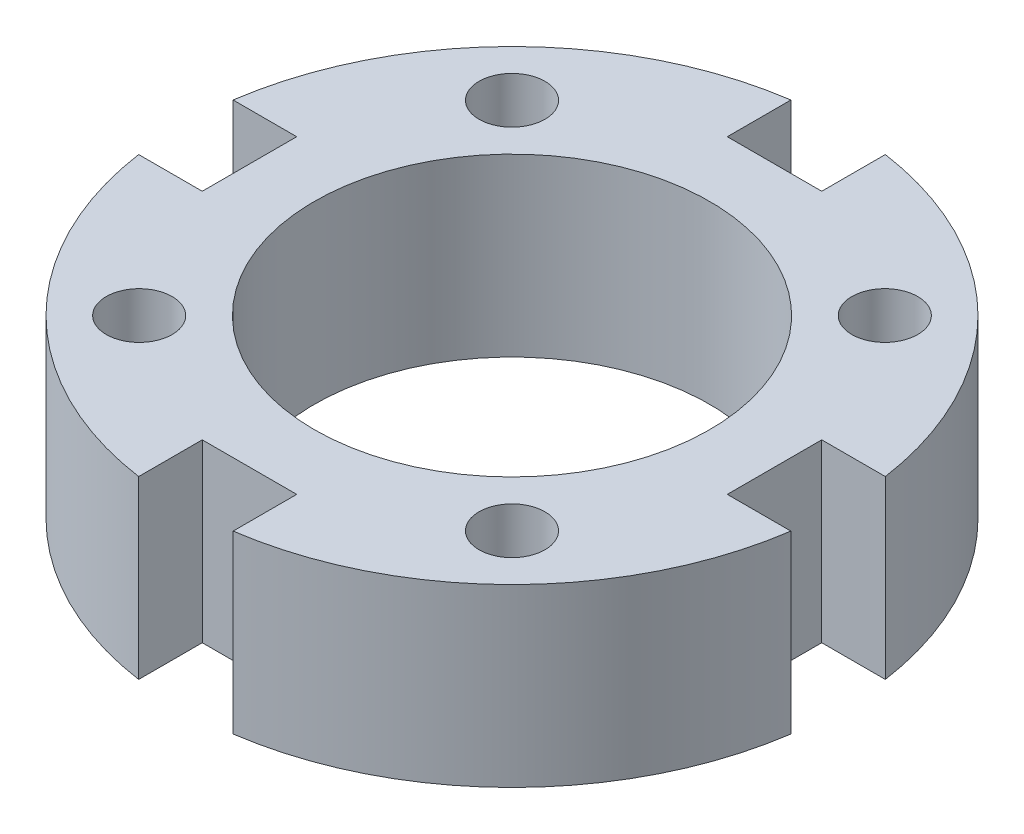
ISO-10303-21;
HEADER;
FILE_DESCRIPTION(('STEP AP214'),'2;1');
FILE_NAME('part.step','',(''),(''),'','','');
FILE_SCHEMA(('AUTOMOTIVE_DESIGN { 1 0 10303 214 1 1 1 1 }'));
ENDSEC;
DATA;
#1=APPLICATION_CONTEXT('core data for automotive mechanical design processes');
#2=APPLICATION_PROTOCOL_DEFINITION('international standard','automotive_design',2000,#1);
#3=PRODUCT_CONTEXT('',#1,'mechanical');
#4=PRODUCT('Part','Part','',(#3));
#5=PRODUCT_RELATED_PRODUCT_CATEGORY('part','',(#4));
#6=PRODUCT_DEFINITION_FORMATION('','',#4);
#7=PRODUCT_DEFINITION_CONTEXT('part definition',#1,'design');
#8=PRODUCT_DEFINITION('design','',#6,#7);
#9=PRODUCT_DEFINITION_SHAPE('','',#8);
#10=(LENGTH_UNIT() NAMED_UNIT(*) SI_UNIT(.MILLI.,.METRE.));
#11=(NAMED_UNIT(*) PLANE_ANGLE_UNIT() SI_UNIT($,.RADIAN.));
#12=(NAMED_UNIT(*) SI_UNIT($,.STERADIAN.) SOLID_ANGLE_UNIT());
#13=UNCERTAINTY_MEASURE_WITH_UNIT(LENGTH_MEASURE(1.E-05),#10,'distance_accuracy_value','');
#14=(GEOMETRIC_REPRESENTATION_CONTEXT(3) GLOBAL_UNCERTAINTY_ASSIGNED_CONTEXT((#13)) GLOBAL_UNIT_ASSIGNED_CONTEXT((#10,
#11,#12)) REPRESENTATION_CONTEXT('',''));
#15=CARTESIAN_POINT('',(0.,0.,0.));
#16=DIRECTION('',(0.,0.,1.));
#17=DIRECTION('',(1.,0.,0.));
#18=AXIS2_PLACEMENT_3D('',#15,#16,#17);
#19=CARTESIAN_POINT('',(0.,4.,0.));
#20=DIRECTION('',(0.,1.,0.));
#21=DIRECTION('',(0.,0.,1.));
#22=AXIS2_PLACEMENT_3D('',#19,#20,#21);
#23=PLANE('',#22);
#24=CARTESIAN_POINT('',(4.24264068711925,4.,-4.24264068711932));
#25=DIRECTION('',(0.,-1.,0.));
#26=DIRECTION('',(-1.,0.,0.));
#27=AXIS2_PLACEMENT_3D('',#24,#25,#26);
#28=CIRCLE('',#27,0.749999999999997);
#29=CARTESIAN_POINT('',(3.49264068711925,4.,-4.24264068711932));
#30=VERTEX_POINT('',#29);
#31=EDGE_CURVE('E386',#30,#30,#28,.T.);
#32=ORIENTED_EDGE('',*,*,#31,.T.);
#33=EDGE_LOOP('',(#32));
#34=FACE_BOUND('',#33,.T.);
#35=CARTESIAN_POINT('',(-4.24264068711931,4.,-4.24264068711926));
#36=DIRECTION('',(0.,-1.,0.));
#37=DIRECTION('',(0.,0.,1.));
#38=AXIS2_PLACEMENT_3D('',#35,#36,#37);
#39=CIRCLE('',#38,0.749999999999997);
#40=CARTESIAN_POINT('',(-4.24264068711931,4.,-3.49264068711927));
#41=VERTEX_POINT('',#40);
#42=EDGE_CURVE('E390',#41,#41,#39,.T.);
#43=ORIENTED_EDGE('',*,*,#42,.T.);
#44=EDGE_LOOP('',(#43));
#45=FACE_BOUND('',#44,.T.);
#46=CARTESIAN_POINT('',(-4.24264068711922,4.,4.24264068711935));
#47=DIRECTION('',(0.,-1.,0.));
#48=DIRECTION('',(1.,0.,0.));
#49=AXIS2_PLACEMENT_3D('',#46,#47,#48);
#50=CIRCLE('',#49,0.749999999999997);
#51=CARTESIAN_POINT('',(-3.49264068711922,4.,4.24264068711934));
#52=VERTEX_POINT('',#51);
#53=EDGE_CURVE('E400',#52,#52,#50,.T.);
#54=ORIENTED_EDGE('',*,*,#53,.T.);
#55=EDGE_LOOP('',(#54));
#56=FACE_BOUND('',#55,.T.);
#57=CARTESIAN_POINT('',(4.24264068711931,4.,4.24264068711926));
#58=DIRECTION('',(0.,-1.,0.));
#59=DIRECTION('',(0.,0.,-1.));
#60=AXIS2_PLACEMENT_3D('',#57,#58,#59);
#61=CIRCLE('',#60,0.749999999999997);
#62=CARTESIAN_POINT('',(4.24264068711931,4.,3.49264068711927));
#63=VERTEX_POINT('',#62);
#64=EDGE_CURVE('E220',#63,#63,#61,.T.);
#65=ORIENTED_EDGE('',*,*,#64,.T.);
#66=EDGE_LOOP('',(#65));
#67=FACE_BOUND('',#66,.T.);
#68=CARTESIAN_POINT('',(0.,4.,0.));
#69=DIRECTION('',(0.,1.,0.));
#70=DIRECTION('',(0.,0.,1.));
#71=AXIS2_PLACEMENT_3D('',#68,#69,#70);
#72=CIRCLE('',#71,4.5);
#73=CARTESIAN_POINT('',(0.,4.,4.5));
#74=VERTEX_POINT('',#73);
#75=EDGE_CURVE('E250',#74,#74,#72,.T.);
#76=ORIENTED_EDGE('',*,*,#75,.F.);
#77=EDGE_LOOP('',(#76));
#78=FACE_BOUND('',#77,.T.);
#79=CARTESIAN_POINT('',(0.,4.,0.));
#80=DIRECTION('',(0.,1.,0.));
#81=DIRECTION('',(0.,0.,1.));
#82=AXIS2_PLACEMENT_3D('',#79,#80,#81);
#83=CIRCLE('',#82,7.5);
#84=CARTESIAN_POINT('',(1.075,4.,7.42255852115697));
#85=VERTEX_POINT('',#84);
#86=CARTESIAN_POINT('',(7.42255852115698,4.,1.07499999999997));
#87=VERTEX_POINT('',#86);
#88=EDGE_CURVE('E256',#85,#87,#83,.T.);
#89=ORIENTED_EDGE('',*,*,#88,.T.);
#90=DIRECTION('',(1.,0.,0.));
#91=VECTOR('',#90,1.);
#92=CARTESIAN_POINT('',(5.97499999997551,4.,1.07499999999998));
#93=LINE('',#92,#91);
#94=CARTESIAN_POINT('',(5.97499999997551,4.,1.07499999999998));
#95=VERTEX_POINT('',#94);
#96=EDGE_CURVE('E177',#95,#87,#93,.T.);
#97=ORIENTED_EDGE('',*,*,#96,.F.);
#98=DIRECTION('',(0.,0.,-1.));
#99=VECTOR('',#98,1.);
#100=CARTESIAN_POINT('',(5.97499999997551,4.,1.07499999999998));
#101=LINE('',#100,#99);
#102=CARTESIAN_POINT('',(5.9749999999755,4.,-1.07500000000002));
#103=VERTEX_POINT('',#102);
#104=EDGE_CURVE('E176',#95,#103,#101,.T.);
#105=ORIENTED_EDGE('',*,*,#104,.T.);
#106=DIRECTION('',(1.,0.,0.));
#107=VECTOR('',#106,1.);
#108=CARTESIAN_POINT('',(5.9749999999755,4.,-1.07500000000002));
#109=LINE('',#108,#107);
#110=CARTESIAN_POINT('',(7.42255852115697,4.,-1.07500000000003));
#111=VERTEX_POINT('',#110);
#112=EDGE_CURVE('E168',#103,#111,#109,.T.);
#113=ORIENTED_EDGE('',*,*,#112,.T.);
#114=CARTESIAN_POINT('',(1.075,4.,-7.42255852115697));
#115=VERTEX_POINT('',#114);
#116=EDGE_CURVE('E260',#111,#115,#83,.T.);
#117=ORIENTED_EDGE('',*,*,#116,.T.);
#118=DIRECTION('',(0.,0.,-1.));
#119=VECTOR('',#118,1.);
#120=CARTESIAN_POINT('',(1.075,4.,-5.97499999997551));
#121=LINE('',#120,#119);
#122=CARTESIAN_POINT('',(1.075,4.,-5.97499999997551));
#123=VERTEX_POINT('',#122);
#124=EDGE_CURVE('E195',#123,#115,#121,.T.);
#125=ORIENTED_EDGE('',*,*,#124,.F.);
#126=DIRECTION('',(-1.,0.,0.));
#127=VECTOR('',#126,1.);
#128=CARTESIAN_POINT('',(1.075,4.,-5.97499999997551));
#129=LINE('',#128,#127);
#130=CARTESIAN_POINT('',(-1.075,4.,-5.97499999997551));
#131=VERTEX_POINT('',#130);
#132=EDGE_CURVE('E205',#123,#131,#129,.T.);
#133=ORIENTED_EDGE('',*,*,#132,.T.);
#134=DIRECTION('',(0.,0.,-1.));
#135=VECTOR('',#134,1.);
#136=CARTESIAN_POINT('',(-1.075,4.,-5.97499999997551));
#137=LINE('',#136,#135);
#138=CARTESIAN_POINT('',(-1.075,4.,-7.42255852115697));
#139=VERTEX_POINT('',#138);
#140=EDGE_CURVE('E192',#131,#139,#137,.T.);
#141=ORIENTED_EDGE('',*,*,#140,.T.);
#142=CARTESIAN_POINT('',(-7.42255852115698,4.,-1.07499999999992));
#143=VERTEX_POINT('',#142);
#144=EDGE_CURVE('E413',#139,#143,#83,.T.);
#145=ORIENTED_EDGE('',*,*,#144,.T.);
#146=DIRECTION('',(-1.,0.,0.));
#147=VECTOR('',#146,1.);
#148=CARTESIAN_POINT('',(-5.97499999997552,4.,-1.07499999999994));
#149=LINE('',#148,#147);
#150=CARTESIAN_POINT('',(-5.97499999997552,4.,-1.07499999999994));
#151=VERTEX_POINT('',#150);
#152=EDGE_CURVE('E215',#151,#143,#149,.T.);
#153=ORIENTED_EDGE('',*,*,#152,.F.);
#154=DIRECTION('',(0.,0.,1.));
#155=VECTOR('',#154,1.);
#156=CARTESIAN_POINT('',(-5.97499999997552,4.,-1.07499999999994));
#157=LINE('',#156,#155);
#158=CARTESIAN_POINT('',(-5.9749999999755,4.,1.07500000000006));
#159=VERTEX_POINT('',#158);
#160=EDGE_CURVE('E200',#151,#159,#157,.T.);
#161=ORIENTED_EDGE('',*,*,#160,.T.);
#162=DIRECTION('',(-1.,0.,0.));
#163=VECTOR('',#162,1.);
#164=CARTESIAN_POINT('',(-5.9749999999755,4.,1.07500000000006));
#165=LINE('',#164,#163);
#166=CARTESIAN_POINT('',(-7.42255852115696,4.,1.07500000000008));
#167=VERTEX_POINT('',#166);
#168=EDGE_CURVE('E212',#159,#167,#165,.T.);
#169=ORIENTED_EDGE('',*,*,#168,.T.);
#170=CARTESIAN_POINT('',(-1.075,4.,7.42255852115697));
#171=VERTEX_POINT('',#170);
#172=EDGE_CURVE('E261',#167,#171,#83,.T.);
#173=ORIENTED_EDGE('',*,*,#172,.T.);
#174=DIRECTION('',(0.,0.,1.));
#175=VECTOR('',#174,1.);
#176=CARTESIAN_POINT('',(-1.075,4.,5.97499999997551));
#177=LINE('',#176,#175);
#178=CARTESIAN_POINT('',(-1.075,4.,5.97499999997551));
#179=VERTEX_POINT('',#178);
#180=EDGE_CURVE('E234',#179,#171,#177,.T.);
#181=ORIENTED_EDGE('',*,*,#180,.F.);
#182=DIRECTION('',(1.,0.,0.));
#183=VECTOR('',#182,1.);
#184=CARTESIAN_POINT('',(-1.075,4.,5.97499999997551));
#185=LINE('',#184,#183);
#186=CARTESIAN_POINT('',(1.075,4.,5.97499999997551));
#187=VERTEX_POINT('',#186);
#188=EDGE_CURVE('E245',#179,#187,#185,.T.);
#189=ORIENTED_EDGE('',*,*,#188,.T.);
#190=DIRECTION('',(0.,0.,1.));
#191=VECTOR('',#190,1.);
#192=CARTESIAN_POINT('',(1.075,4.,5.97499999997551));
#193=LINE('',#192,#191);
#194=EDGE_CURVE('E231',#187,#85,#193,.T.);
#195=ORIENTED_EDGE('',*,*,#194,.T.);
#196=EDGE_LOOP('',(#89,#97,#105,#113,#117,#125,#133,#141,#145,#153,#161,#169,#173,#181,#189,#195));
#197=FACE_BOUND('',#196,.T.);
#198=ADVANCED_FACE('F44',(#34,#45,#56,#67,#78,#197),#23,.T.);
#199=CARTESIAN_POINT('',(0.,0.,0.));
#200=DIRECTION('',(0.,1.,0.));
#201=DIRECTION('',(0.,0.,1.));
#202=AXIS2_PLACEMENT_3D('',#199,#200,#201);
#203=PLANE('',#202);
#204=CARTESIAN_POINT('',(4.24264068711925,0.,-4.24264068711932));
#205=DIRECTION('',(0.,-1.,0.));
#206=DIRECTION('',(-1.,0.,0.));
#207=AXIS2_PLACEMENT_3D('',#204,#205,#206);
#208=CIRCLE('',#207,0.749999999999997);
#209=CARTESIAN_POINT('',(3.49264068711925,0.,-4.24264068711932));
#210=VERTEX_POINT('',#209);
#211=EDGE_CURVE('E389',#210,#210,#208,.T.);
#212=ORIENTED_EDGE('',*,*,#211,.F.);
#213=EDGE_LOOP('',(#212));
#214=FACE_BOUND('',#213,.T.);
#215=CARTESIAN_POINT('',(-4.24264068711931,0.,-4.24264068711926));
#216=DIRECTION('',(0.,-1.,0.));
#217=DIRECTION('',(0.,0.,1.));
#218=AXIS2_PLACEMENT_3D('',#215,#216,#217);
#219=CIRCLE('',#218,0.749999999999997);
#220=CARTESIAN_POINT('',(-4.24264068711931,0.,-3.49264068711927));
#221=VERTEX_POINT('',#220);
#222=EDGE_CURVE('E395',#221,#221,#219,.T.);
#223=ORIENTED_EDGE('',*,*,#222,.F.);
#224=EDGE_LOOP('',(#223));
#225=FACE_BOUND('',#224,.T.);
#226=CARTESIAN_POINT('',(-4.24264068711922,0.,4.24264068711935));
#227=DIRECTION('',(0.,-1.,0.));
#228=DIRECTION('',(1.,0.,0.));
#229=AXIS2_PLACEMENT_3D('',#226,#227,#228);
#230=CIRCLE('',#229,0.749999999999997);
#231=CARTESIAN_POINT('',(-3.49264068711922,0.,4.24264068711934));
#232=VERTEX_POINT('',#231);
#233=EDGE_CURVE('E403',#232,#232,#230,.T.);
#234=ORIENTED_EDGE('',*,*,#233,.F.);
#235=EDGE_LOOP('',(#234));
#236=FACE_BOUND('',#235,.T.);
#237=CARTESIAN_POINT('',(4.24264068711931,0.,4.24264068711926));
#238=DIRECTION('',(0.,-1.,0.));
#239=DIRECTION('',(0.,0.,-1.));
#240=AXIS2_PLACEMENT_3D('',#237,#238,#239);
#241=CIRCLE('',#240,0.749999999999997);
#242=CARTESIAN_POINT('',(4.24264068711931,0.,3.49264068711927));
#243=VERTEX_POINT('',#242);
#244=EDGE_CURVE('E392',#243,#243,#241,.T.);
#245=ORIENTED_EDGE('',*,*,#244,.F.);
#246=EDGE_LOOP('',(#245));
#247=FACE_BOUND('',#246,.T.);
#248=CARTESIAN_POINT('',(0.,0.,0.));
#249=DIRECTION('',(0.,1.,0.));
#250=DIRECTION('',(0.,0.,1.));
#251=AXIS2_PLACEMENT_3D('',#248,#249,#250);
#252=CIRCLE('',#251,4.5);
#253=CARTESIAN_POINT('',(0.,0.,4.5));
#254=VERTEX_POINT('',#253);
#255=EDGE_CURVE('E248',#254,#254,#252,.T.);
#256=ORIENTED_EDGE('',*,*,#255,.T.);
#257=EDGE_LOOP('',(#256));
#258=FACE_BOUND('',#257,.T.);
#259=DIRECTION('',(-1.,0.,0.));
#260=VECTOR('',#259,1.);
#261=CARTESIAN_POINT('',(7.49999999997551,0.,1.07499999999997));
#262=LINE('',#261,#260);
#263=CARTESIAN_POINT('',(7.42255852115698,0.,1.07499999999997));
#264=VERTEX_POINT('',#263);
#265=CARTESIAN_POINT('',(5.97499999997551,0.,1.07499999999998));
#266=VERTEX_POINT('',#265);
#267=EDGE_CURVE('E158',#264,#266,#262,.T.);
#268=ORIENTED_EDGE('',*,*,#267,.F.);
#269=CARTESIAN_POINT('',(0.,0.,0.));
#270=DIRECTION('',(0.,1.,0.));
#271=DIRECTION('',(0.,0.,1.));
#272=AXIS2_PLACEMENT_3D('',#269,#270,#271);
#273=CIRCLE('',#272,7.5);
#274=CARTESIAN_POINT('',(1.075,0.,7.42255852115697));
#275=VERTEX_POINT('',#274);
#276=EDGE_CURVE('E262',#275,#264,#273,.T.);
#277=ORIENTED_EDGE('',*,*,#276,.F.);
#278=DIRECTION('',(0.,0.,-1.));
#279=VECTOR('',#278,1.);
#280=CARTESIAN_POINT('',(1.075,0.,7.49999999997551));
#281=LINE('',#280,#279);
#282=CARTESIAN_POINT('',(1.075,0.,5.97499999997551));
#283=VERTEX_POINT('',#282);
#284=EDGE_CURVE('E184',#275,#283,#281,.T.);
#285=ORIENTED_EDGE('',*,*,#284,.T.);
#286=DIRECTION('',(1.,0.,0.));
#287=VECTOR('',#286,1.);
#288=CARTESIAN_POINT('',(-1.075,0.,5.97499999997551));
#289=LINE('',#288,#287);
#290=CARTESIAN_POINT('',(-1.075,0.,5.97499999997551));
#291=VERTEX_POINT('',#290);
#292=EDGE_CURVE('E237',#291,#283,#289,.T.);
#293=ORIENTED_EDGE('',*,*,#292,.F.);
#294=DIRECTION('',(0.,0.,-1.));
#295=VECTOR('',#294,1.);
#296=CARTESIAN_POINT('',(-1.075,0.,7.49999999997551));
#297=LINE('',#296,#295);
#298=CARTESIAN_POINT('',(-1.075,0.,7.42255852115697));
#299=VERTEX_POINT('',#298);
#300=EDGE_CURVE('E228',#299,#291,#297,.T.);
#301=ORIENTED_EDGE('',*,*,#300,.F.);
#302=CARTESIAN_POINT('',(-7.42255852115696,0.,1.07500000000008));
#303=VERTEX_POINT('',#302);
#304=EDGE_CURVE('E253',#303,#299,#273,.T.);
#305=ORIENTED_EDGE('',*,*,#304,.F.);
#306=DIRECTION('',(1.,0.,0.));
#307=VECTOR('',#306,1.);
#308=CARTESIAN_POINT('',(-7.4999999999755,0.,1.07500000000008));
#309=LINE('',#308,#307);
#310=CARTESIAN_POINT('',(-5.9749999999755,0.,1.07500000000006));
#311=VERTEX_POINT('',#310);
#312=EDGE_CURVE('E59',#303,#311,#309,.T.);
#313=ORIENTED_EDGE('',*,*,#312,.T.);
#314=DIRECTION('',(0.,0.,1.));
#315=VECTOR('',#314,1.);
#316=CARTESIAN_POINT('',(-5.97499999997552,0.,-1.07499999999994));
#317=LINE('',#316,#315);
#318=CARTESIAN_POINT('',(-5.97499999997552,0.,-1.07499999999994));
#319=VERTEX_POINT('',#318);
#320=EDGE_CURVE('E217',#319,#311,#317,.T.);
#321=ORIENTED_EDGE('',*,*,#320,.F.);
#322=DIRECTION('',(1.,0.,0.));
#323=VECTOR('',#322,1.);
#324=CARTESIAN_POINT('',(-7.49999999997552,0.,-1.07499999999992));
#325=LINE('',#324,#323);
#326=CARTESIAN_POINT('',(-7.42255852115698,0.,-1.07499999999992));
#327=VERTEX_POINT('',#326);
#328=EDGE_CURVE('E209',#327,#319,#325,.T.);
#329=ORIENTED_EDGE('',*,*,#328,.F.);
#330=CARTESIAN_POINT('',(-1.075,0.,-7.42255852115697));
#331=VERTEX_POINT('',#330);
#332=EDGE_CURVE('E288',#331,#327,#273,.T.);
#333=ORIENTED_EDGE('',*,*,#332,.F.);
#334=DIRECTION('',(0.,0.,1.));
#335=VECTOR('',#334,1.);
#336=CARTESIAN_POINT('',(-1.075,0.,-7.49999999997551));
#337=LINE('',#336,#335);
#338=CARTESIAN_POINT('',(-1.075,0.,-5.97499999997551));
#339=VERTEX_POINT('',#338);
#340=EDGE_CURVE('E67',#331,#339,#337,.T.);
#341=ORIENTED_EDGE('',*,*,#340,.T.);
#342=DIRECTION('',(-1.,0.,0.));
#343=VECTOR('',#342,1.);
#344=CARTESIAN_POINT('',(1.075,0.,-5.97499999997551));
#345=LINE('',#344,#343);
#346=CARTESIAN_POINT('',(1.075,0.,-5.97499999997551));
#347=VERTEX_POINT('',#346);
#348=EDGE_CURVE('E197',#347,#339,#345,.T.);
#349=ORIENTED_EDGE('',*,*,#348,.F.);
#350=DIRECTION('',(0.,0.,1.));
#351=VECTOR('',#350,1.);
#352=CARTESIAN_POINT('',(1.075,0.,-7.49999999997551));
#353=LINE('',#352,#351);
#354=CARTESIAN_POINT('',(1.075,0.,-7.42255852115697));
#355=VERTEX_POINT('',#354);
#356=EDGE_CURVE('E189',#355,#347,#353,.T.);
#357=ORIENTED_EDGE('',*,*,#356,.F.);
#358=CARTESIAN_POINT('',(7.42255852115697,0.,-1.07500000000003));
#359=VERTEX_POINT('',#358);
#360=EDGE_CURVE('E264',#359,#355,#273,.T.);
#361=ORIENTED_EDGE('',*,*,#360,.F.);
#362=DIRECTION('',(-1.,0.,0.));
#363=VECTOR('',#362,1.);
#364=CARTESIAN_POINT('',(7.4999999999755,0.,-1.07500000000003));
#365=LINE('',#364,#363);
#366=CARTESIAN_POINT('',(5.9749999999755,0.,-1.07500000000002));
#367=VERTEX_POINT('',#366);
#368=EDGE_CURVE('E182',#359,#367,#365,.T.);
#369=ORIENTED_EDGE('',*,*,#368,.T.);
#370=DIRECTION('',(0.,0.,-1.));
#371=VECTOR('',#370,1.);
#372=CARTESIAN_POINT('',(5.97499999997551,0.,1.07499999999998));
#373=LINE('',#372,#371);
#374=EDGE_CURVE('E173',#266,#367,#373,.T.);
#375=ORIENTED_EDGE('',*,*,#374,.F.);
#376=EDGE_LOOP('',(#268,#277,#285,#293,#301,#305,#313,#321,#329,#333,#341,#349,#357,#361,#369,#375));
#377=FACE_BOUND('',#376,.T.);
#378=ADVANCED_FACE('F180',(#214,#225,#236,#247,#258,#377),#203,.F.);
#379=CARTESIAN_POINT('',(0.,4.,0.));
#380=DIRECTION('',(0.,-1.,0.));
#381=DIRECTION('',(0.,0.,-1.));
#382=AXIS2_PLACEMENT_3D('',#379,#380,#381);
#383=CYLINDRICAL_SURFACE('',#382,7.5);
#384=DIRECTION('',(0.,-1.,0.));
#385=VECTOR('',#384,1.);
#386=CARTESIAN_POINT('',(7.42255852115698,4.,1.07499999999997));
#387=LINE('',#386,#385);
#388=EDGE_CURVE('E12',#87,#264,#387,.T.);
#389=ORIENTED_EDGE('',*,*,#388,.F.);
#390=ORIENTED_EDGE('',*,*,#88,.F.);
#391=DIRECTION('',(0.,-1.,0.));
#392=VECTOR('',#391,1.);
#393=CARTESIAN_POINT('',(1.075,4.,7.42255852115697));
#394=LINE('',#393,#392);
#395=EDGE_CURVE('E259',#85,#275,#394,.T.);
#396=ORIENTED_EDGE('',*,*,#395,.T.);
#397=ORIENTED_EDGE('',*,*,#276,.T.);
#398=EDGE_LOOP('',(#389,#390,#396,#397));
#399=FACE_BOUND('',#398,.T.);
#400=ADVANCED_FACE('F311',(#399),#383,.T.);
#401=ORIENTED_EDGE('',*,*,#116,.F.);
#402=DIRECTION('',(0.,-1.,0.));
#403=VECTOR('',#402,1.);
#404=CARTESIAN_POINT('',(7.42255852115697,4.,-1.07500000000003));
#405=LINE('',#404,#403);
#406=EDGE_CURVE('E52',#111,#359,#405,.T.);
#407=ORIENTED_EDGE('',*,*,#406,.T.);
#408=ORIENTED_EDGE('',*,*,#360,.T.);
#409=DIRECTION('',(0.,-1.,0.));
#410=VECTOR('',#409,1.);
#411=CARTESIAN_POINT('',(1.075,4.,-7.42255852115697));
#412=LINE('',#411,#410);
#413=EDGE_CURVE('E276',#115,#355,#412,.T.);
#414=ORIENTED_EDGE('',*,*,#413,.F.);
#415=EDGE_LOOP('',(#401,#407,#408,#414));
#416=FACE_BOUND('',#415,.T.);
#417=ADVANCED_FACE('F281',(#416),#383,.T.);
#418=ORIENTED_EDGE('',*,*,#144,.F.);
#419=DIRECTION('',(0.,-1.,0.));
#420=VECTOR('',#419,1.);
#421=CARTESIAN_POINT('',(-1.075,4.,-7.42255852115697));
#422=LINE('',#421,#420);
#423=EDGE_CURVE('E274',#139,#331,#422,.T.);
#424=ORIENTED_EDGE('',*,*,#423,.T.);
#425=ORIENTED_EDGE('',*,*,#332,.T.);
#426=DIRECTION('',(0.,-1.,0.));
#427=VECTOR('',#426,1.);
#428=CARTESIAN_POINT('',(-7.42255852115698,4.,-1.07499999999992));
#429=LINE('',#428,#427);
#430=EDGE_CURVE('E272',#143,#327,#429,.T.);
#431=ORIENTED_EDGE('',*,*,#430,.F.);
#432=EDGE_LOOP('',(#418,#424,#425,#431));
#433=FACE_BOUND('',#432,.T.);
#434=ADVANCED_FACE('F317',(#433),#383,.T.);
#435=ORIENTED_EDGE('',*,*,#172,.F.);
#436=DIRECTION('',(0.,-1.,0.));
#437=VECTOR('',#436,1.);
#438=CARTESIAN_POINT('',(-7.42255852115696,4.,1.07500000000008));
#439=LINE('',#438,#437);
#440=EDGE_CURVE('E270',#167,#303,#439,.T.);
#441=ORIENTED_EDGE('',*,*,#440,.T.);
#442=ORIENTED_EDGE('',*,*,#304,.T.);
#443=DIRECTION('',(0.,-1.,0.));
#444=VECTOR('',#443,1.);
#445=CARTESIAN_POINT('',(-1.075,4.,7.42255852115697));
#446=LINE('',#445,#444);
#447=EDGE_CURVE('E267',#171,#299,#446,.T.);
#448=ORIENTED_EDGE('',*,*,#447,.F.);
#449=EDGE_LOOP('',(#435,#441,#442,#448));
#450=FACE_BOUND('',#449,.T.);
#451=ADVANCED_FACE('F46',(#450),#383,.T.);
#452=CARTESIAN_POINT('',(0.,4.,0.));
#453=DIRECTION('',(0.,-1.,0.));
#454=DIRECTION('',(0.,0.,-1.));
#455=AXIS2_PLACEMENT_3D('',#452,#453,#454);
#456=CYLINDRICAL_SURFACE('',#455,4.5);
#457=ORIENTED_EDGE('',*,*,#75,.T.);
#458=EDGE_LOOP('',(#457));
#459=FACE_BOUND('',#458,.T.);
#460=ORIENTED_EDGE('',*,*,#255,.F.);
#461=EDGE_LOOP('',(#460));
#462=FACE_BOUND('',#461,.T.);
#463=ADVANCED_FACE('F320',(#459,#462),#456,.F.);
#464=CARTESIAN_POINT('',(-1.075,0.,0.));
#465=DIRECTION('',(1.,0.,0.));
#466=DIRECTION('',(0.,0.,-1.));
#467=AXIS2_PLACEMENT_3D('',#464,#465,#466);
#468=PLANE('',#467);
#469=ORIENTED_EDGE('',*,*,#447,.T.);
#470=ORIENTED_EDGE('',*,*,#300,.T.);
#471=DIRECTION('',(0.,1.,0.));
#472=VECTOR('',#471,1.);
#473=CARTESIAN_POINT('',(-1.075,0.,5.97499999997551));
#474=LINE('',#473,#472);
#475=EDGE_CURVE('E230',#291,#179,#474,.T.);
#476=ORIENTED_EDGE('',*,*,#475,.T.);
#477=ORIENTED_EDGE('',*,*,#180,.T.);
#478=EDGE_LOOP('',(#469,#470,#476,#477));
#479=FACE_BOUND('',#478,.T.);
#480=ADVANCED_FACE('F299',(#479),#468,.T.);
#481=CARTESIAN_POINT('',(1.075,0.,0.));
#482=DIRECTION('',(1.,0.,0.));
#483=DIRECTION('',(0.,0.,-1.));
#484=AXIS2_PLACEMENT_3D('',#481,#482,#483);
#485=PLANE('',#484);
#486=ORIENTED_EDGE('',*,*,#194,.F.);
#487=DIRECTION('',(0.,1.,0.));
#488=VECTOR('',#487,1.);
#489=CARTESIAN_POINT('',(1.075,0.,5.97499999997551));
#490=LINE('',#489,#488);
#491=EDGE_CURVE('E240',#283,#187,#490,.T.);
#492=ORIENTED_EDGE('',*,*,#491,.F.);
#493=ORIENTED_EDGE('',*,*,#284,.F.);
#494=ORIENTED_EDGE('',*,*,#395,.F.);
#495=EDGE_LOOP('',(#486,#492,#493,#494));
#496=FACE_BOUND('',#495,.T.);
#497=ADVANCED_FACE('F307',(#496),#485,.F.);
#498=CARTESIAN_POINT('',(-1.075,0.,5.97499999997551));
#499=DIRECTION('',(0.,0.,-1.));
#500=DIRECTION('',(-1.,0.,0.));
#501=AXIS2_PLACEMENT_3D('',#498,#499,#500);
#502=PLANE('',#501);
#503=ORIENTED_EDGE('',*,*,#491,.T.);
#504=ORIENTED_EDGE('',*,*,#188,.F.);
#505=ORIENTED_EDGE('',*,*,#475,.F.);
#506=ORIENTED_EDGE('',*,*,#292,.T.);
#507=EDGE_LOOP('',(#503,#504,#505,#506));
#508=FACE_BOUND('',#507,.T.);
#509=ADVANCED_FACE('F305',(#508),#502,.F.);
#510=CARTESIAN_POINT('',(0.,0.,-1.075));
#511=DIRECTION('',(0.,0.,1.));
#512=DIRECTION('',(1.,0.,0.));
#513=AXIS2_PLACEMENT_3D('',#510,#511,#512);
#514=PLANE('',#513);
#515=ORIENTED_EDGE('',*,*,#430,.T.);
#516=ORIENTED_EDGE('',*,*,#328,.T.);
#517=DIRECTION('',(0.,1.,0.));
#518=VECTOR('',#517,1.);
#519=CARTESIAN_POINT('',(-5.97499999997552,0.,-1.07499999999994));
#520=LINE('',#519,#518);
#521=EDGE_CURVE('E211',#319,#151,#520,.T.);
#522=ORIENTED_EDGE('',*,*,#521,.T.);
#523=ORIENTED_EDGE('',*,*,#152,.T.);
#524=EDGE_LOOP('',(#515,#516,#522,#523));
#525=FACE_BOUND('',#524,.T.);
#526=ADVANCED_FACE('F334',(#525),#514,.T.);
#527=CARTESIAN_POINT('',(0.,0.,1.075));
#528=DIRECTION('',(0.,0.,1.));
#529=DIRECTION('',(1.,0.,0.));
#530=AXIS2_PLACEMENT_3D('',#527,#528,#529);
#531=PLANE('',#530);
#532=ORIENTED_EDGE('',*,*,#168,.F.);
#533=DIRECTION('',(0.,1.,0.));
#534=VECTOR('',#533,1.);
#535=CARTESIAN_POINT('',(-5.9749999999755,0.,1.07500000000006));
#536=LINE('',#535,#534);
#537=EDGE_CURVE('E219',#311,#159,#536,.T.);
#538=ORIENTED_EDGE('',*,*,#537,.F.);
#539=ORIENTED_EDGE('',*,*,#312,.F.);
#540=ORIENTED_EDGE('',*,*,#440,.F.);
#541=EDGE_LOOP('',(#532,#538,#539,#540));
#542=FACE_BOUND('',#541,.T.);
#543=ADVANCED_FACE('F343',(#542),#531,.F.);
#544=CARTESIAN_POINT('',(-5.97499999997552,0.,-1.07499999999994));
#545=DIRECTION('',(1.,0.,0.));
#546=DIRECTION('',(0.,0.,-1.));
#547=AXIS2_PLACEMENT_3D('',#544,#545,#546);
#548=PLANE('',#547);
#549=ORIENTED_EDGE('',*,*,#537,.T.);
#550=ORIENTED_EDGE('',*,*,#160,.F.);
#551=ORIENTED_EDGE('',*,*,#521,.F.);
#552=ORIENTED_EDGE('',*,*,#320,.T.);
#553=EDGE_LOOP('',(#549,#550,#551,#552));
#554=FACE_BOUND('',#553,.T.);
#555=ADVANCED_FACE('F339',(#554),#548,.F.);
#556=CARTESIAN_POINT('',(1.075,0.,0.));
#557=DIRECTION('',(-1.,0.,0.));
#558=DIRECTION('',(0.,0.,1.));
#559=AXIS2_PLACEMENT_3D('',#556,#557,#558);
#560=PLANE('',#559);
#561=ORIENTED_EDGE('',*,*,#413,.T.);
#562=ORIENTED_EDGE('',*,*,#356,.T.);
#563=DIRECTION('',(0.,1.,0.));
#564=VECTOR('',#563,1.);
#565=CARTESIAN_POINT('',(1.075,0.,-5.97499999997551));
#566=LINE('',#565,#564);
#567=EDGE_CURVE('E191',#347,#123,#566,.T.);
#568=ORIENTED_EDGE('',*,*,#567,.T.);
#569=ORIENTED_EDGE('',*,*,#124,.T.);
#570=EDGE_LOOP('',(#561,#562,#568,#569));
#571=FACE_BOUND('',#570,.T.);
#572=ADVANCED_FACE('F342',(#571),#560,.T.);
#573=CARTESIAN_POINT('',(-1.075,0.,0.));
#574=DIRECTION('',(-1.,0.,0.));
#575=DIRECTION('',(0.,0.,1.));
#576=AXIS2_PLACEMENT_3D('',#573,#574,#575);
#577=PLANE('',#576);
#578=ORIENTED_EDGE('',*,*,#140,.F.);
#579=DIRECTION('',(0.,1.,0.));
#580=VECTOR('',#579,1.);
#581=CARTESIAN_POINT('',(-1.075,0.,-5.97499999997551));
#582=LINE('',#581,#580);
#583=EDGE_CURVE('E199',#339,#131,#582,.T.);
#584=ORIENTED_EDGE('',*,*,#583,.F.);
#585=ORIENTED_EDGE('',*,*,#340,.F.);
#586=ORIENTED_EDGE('',*,*,#423,.F.);
#587=EDGE_LOOP('',(#578,#584,#585,#586));
#588=FACE_BOUND('',#587,.T.);
#589=ADVANCED_FACE('F353',(#588),#577,.F.);
#590=CARTESIAN_POINT('',(1.075,0.,-5.97499999997551));
#591=DIRECTION('',(0.,0.,1.));
#592=DIRECTION('',(1.,0.,0.));
#593=AXIS2_PLACEMENT_3D('',#590,#591,#592);
#594=PLANE('',#593);
#595=ORIENTED_EDGE('',*,*,#583,.T.);
#596=ORIENTED_EDGE('',*,*,#132,.F.);
#597=ORIENTED_EDGE('',*,*,#567,.F.);
#598=ORIENTED_EDGE('',*,*,#348,.T.);
#599=EDGE_LOOP('',(#595,#596,#597,#598));
#600=FACE_BOUND('',#599,.T.);
#601=ADVANCED_FACE('F350',(#600),#594,.F.);
#602=CARTESIAN_POINT('',(0.,0.,1.075));
#603=DIRECTION('',(0.,0.,-1.));
#604=DIRECTION('',(-1.,0.,0.));
#605=AXIS2_PLACEMENT_3D('',#602,#603,#604);
#606=PLANE('',#605);
#607=ORIENTED_EDGE('',*,*,#388,.T.);
#608=ORIENTED_EDGE('',*,*,#267,.T.);
#609=DIRECTION('',(0.,1.,0.));
#610=VECTOR('',#609,1.);
#611=CARTESIAN_POINT('',(5.97499999997551,0.,1.07499999999998));
#612=LINE('',#611,#610);
#613=EDGE_CURVE('E161',#266,#95,#612,.T.);
#614=ORIENTED_EDGE('',*,*,#613,.T.);
#615=ORIENTED_EDGE('',*,*,#96,.T.);
#616=EDGE_LOOP('',(#607,#608,#614,#615));
#617=FACE_BOUND('',#616,.T.);
#618=ADVANCED_FACE('F160',(#617),#606,.T.);
#619=CARTESIAN_POINT('',(0.,0.,-1.075));
#620=DIRECTION('',(0.,0.,-1.));
#621=DIRECTION('',(-1.,0.,0.));
#622=AXIS2_PLACEMENT_3D('',#619,#620,#621);
#623=PLANE('',#622);
#624=ORIENTED_EDGE('',*,*,#112,.F.);
#625=DIRECTION('',(0.,1.,0.));
#626=VECTOR('',#625,1.);
#627=CARTESIAN_POINT('',(5.9749999999755,0.,-1.07500000000002));
#628=LINE('',#627,#626);
#629=EDGE_CURVE('E411',#367,#103,#628,.T.);
#630=ORIENTED_EDGE('',*,*,#629,.F.);
#631=ORIENTED_EDGE('',*,*,#368,.F.);
#632=ORIENTED_EDGE('',*,*,#406,.F.);
#633=EDGE_LOOP('',(#624,#630,#631,#632));
#634=FACE_BOUND('',#633,.T.);
#635=ADVANCED_FACE('F363',(#634),#623,.F.);
#636=CARTESIAN_POINT('',(5.97499999997551,0.,1.07499999999998));
#637=DIRECTION('',(-1.,0.,0.));
#638=DIRECTION('',(0.,0.,1.));
#639=AXIS2_PLACEMENT_3D('',#636,#637,#638);
#640=PLANE('',#639);
#641=ORIENTED_EDGE('',*,*,#629,.T.);
#642=ORIENTED_EDGE('',*,*,#104,.F.);
#643=ORIENTED_EDGE('',*,*,#613,.F.);
#644=ORIENTED_EDGE('',*,*,#374,.T.);
#645=EDGE_LOOP('',(#641,#642,#643,#644));
#646=FACE_BOUND('',#645,.T.);
#647=ADVANCED_FACE('F172',(#646),#640,.F.);
#648=CARTESIAN_POINT('',(4.24264068711931,4.,4.24264068711926));
#649=DIRECTION('',(0.,-1.,0.));
#650=DIRECTION('',(0.,0.,-1.));
#651=AXIS2_PLACEMENT_3D('',#648,#649,#650);
#652=CYLINDRICAL_SURFACE('',#651,0.749999999999997);
#653=ORIENTED_EDGE('',*,*,#64,.F.);
#654=EDGE_LOOP('',(#653));
#655=FACE_BOUND('',#654,.T.);
#656=ORIENTED_EDGE('',*,*,#244,.T.);
#657=EDGE_LOOP('',(#656));
#658=FACE_BOUND('',#657,.T.);
#659=ADVANCED_FACE('F362',(#655,#658),#652,.F.);
#660=CARTESIAN_POINT('',(-4.24264068711922,4.,4.24264068711935));
#661=DIRECTION('',(0.,-1.,0.));
#662=DIRECTION('',(0.,0.,-1.));
#663=AXIS2_PLACEMENT_3D('',#660,#661,#662);
#664=CYLINDRICAL_SURFACE('',#663,0.749999999999997);
#665=ORIENTED_EDGE('',*,*,#53,.F.);
#666=EDGE_LOOP('',(#665));
#667=FACE_BOUND('',#666,.T.);
#668=ORIENTED_EDGE('',*,*,#233,.T.);
#669=EDGE_LOOP('',(#668));
#670=FACE_BOUND('',#669,.T.);
#671=ADVANCED_FACE('F370',(#667,#670),#664,.F.);
#672=CARTESIAN_POINT('',(-4.24264068711931,4.,-4.24264068711926));
#673=DIRECTION('',(0.,-1.,0.));
#674=DIRECTION('',(0.,0.,-1.));
#675=AXIS2_PLACEMENT_3D('',#672,#673,#674);
#676=CYLINDRICAL_SURFACE('',#675,0.749999999999997);
#677=ORIENTED_EDGE('',*,*,#42,.F.);
#678=EDGE_LOOP('',(#677));
#679=FACE_BOUND('',#678,.T.);
#680=ORIENTED_EDGE('',*,*,#222,.T.);
#681=EDGE_LOOP('',(#680));
#682=FACE_BOUND('',#681,.T.);
#683=ADVANCED_FACE('F374',(#679,#682),#676,.F.);
#684=CARTESIAN_POINT('',(4.24264068711925,4.,-4.24264068711932));
#685=DIRECTION('',(0.,-1.,0.));
#686=DIRECTION('',(0.,0.,-1.));
#687=AXIS2_PLACEMENT_3D('',#684,#685,#686);
#688=CYLINDRICAL_SURFACE('',#687,0.749999999999997);
#689=ORIENTED_EDGE('',*,*,#31,.F.);
#690=EDGE_LOOP('',(#689));
#691=FACE_BOUND('',#690,.T.);
#692=ORIENTED_EDGE('',*,*,#211,.T.);
#693=EDGE_LOOP('',(#692));
#694=FACE_BOUND('',#693,.T.);
#695=ADVANCED_FACE('F378',(#691,#694),#688,.F.);
#696=CLOSED_SHELL('',(#198,#378,#400,#417,#434,#451,#463,#480,#497,#509,#526,#543,#555,#572,
#589,#601,#618,#635,#647,#659,#671,#683,#695));
#697=MANIFOLD_SOLID_BREP('B2',#696);
#698=ADVANCED_BREP_SHAPE_REPRESENTATION('',(#18,#697),#14);
#699=SHAPE_DEFINITION_REPRESENTATION(#9,#698);
ENDSEC;
END-ISO-10303-21;
